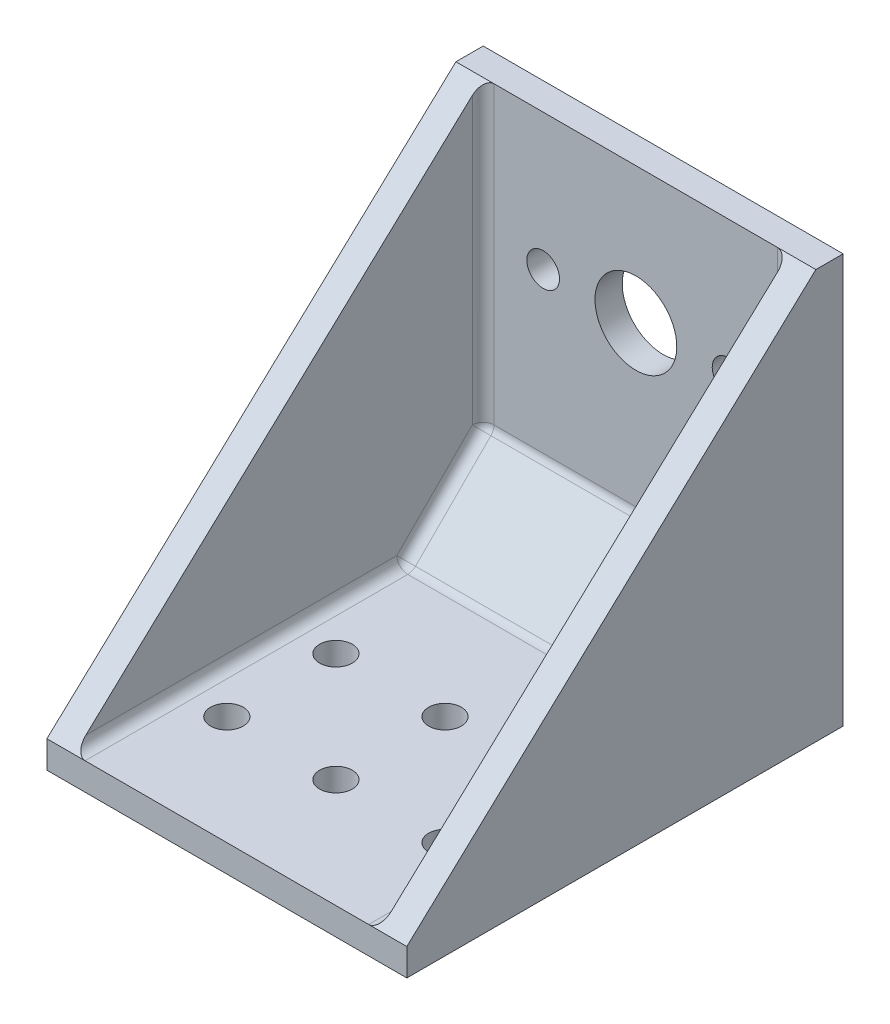
ISO-10303-21;
HEADER;
FILE_DESCRIPTION(('STEP AP214'),'2;1');
FILE_NAME('part.step','',(''),(''),'','','');
FILE_SCHEMA(('AUTOMOTIVE_DESIGN { 1 0 10303 214 1 1 1 1 }'));
ENDSEC;
DATA;
#1=APPLICATION_CONTEXT('core data for automotive mechanical design processes');
#2=APPLICATION_PROTOCOL_DEFINITION('international standard','automotive_design',2000,#1);
#3=PRODUCT_CONTEXT('',#1,'mechanical');
#4=PRODUCT('Part','Part','',(#3));
#5=PRODUCT_RELATED_PRODUCT_CATEGORY('part','',(#4));
#6=PRODUCT_DEFINITION_FORMATION('','',#4);
#7=PRODUCT_DEFINITION_CONTEXT('part definition',#1,'design');
#8=PRODUCT_DEFINITION('design','',#6,#7);
#9=PRODUCT_DEFINITION_SHAPE('','',#8);
#10=(LENGTH_UNIT() NAMED_UNIT(*) SI_UNIT(.MILLI.,.METRE.));
#11=(NAMED_UNIT(*) PLANE_ANGLE_UNIT() SI_UNIT($,.RADIAN.));
#12=(NAMED_UNIT(*) SI_UNIT($,.STERADIAN.) SOLID_ANGLE_UNIT());
#13=UNCERTAINTY_MEASURE_WITH_UNIT(LENGTH_MEASURE(1.E-05),#10,'distance_accuracy_value','');
#14=(GEOMETRIC_REPRESENTATION_CONTEXT(3) GLOBAL_UNCERTAINTY_ASSIGNED_CONTEXT((#13)) GLOBAL_UNIT_ASSIGNED_CONTEXT((#10,
#11,#12)) REPRESENTATION_CONTEXT('',''));
#15=CARTESIAN_POINT('',(0.,0.,0.));
#16=DIRECTION('',(0.,0.,1.));
#17=DIRECTION('',(1.,0.,0.));
#18=AXIS2_PLACEMENT_3D('',#15,#16,#17);
#19=CARTESIAN_POINT('',(28.,10.4142135623731,3.49999999999999));
#20=DIRECTION('',(1.,0.,0.));
#21=DIRECTION('',(0.,0.,-1.));
#22=AXIS2_PLACEMENT_3D('',#19,#20,#21);
#23=CYLINDRICAL_SURFACE('',#22,1.);
#24=DIRECTION('',(1.,0.,0.));
#25=VECTOR('',#24,1.);
#26=CARTESIAN_POINT('',(28.,10.4142135623731,2.49999999999999));
#27=LINE('',#26,#25);
#28=CARTESIAN_POINT('',(27.,10.4142135623731,2.49999999999999));
#29=VERTEX_POINT('',#28);
#30=CARTESIAN_POINT('',(1.,10.4142135623731,2.49999999999999));
#31=VERTEX_POINT('',#30);
#32=EDGE_CURVE('E259',#29,#31,#27,.F.);
#33=ORIENTED_EDGE('',*,*,#32,.T.);
#34=CARTESIAN_POINT('',(1.,10.4142135623731,3.49999999999999));
#35=DIRECTION('',(1.,0.,0.));
#36=DIRECTION('',(0.,0.,-1.));
#37=AXIS2_PLACEMENT_3D('',#34,#35,#36);
#38=CIRCLE('',#37,1.);
#39=CARTESIAN_POINT('',(0.999999999999989,9.70710678118656,2.79289321881344));
#40=VERTEX_POINT('',#39);
#41=EDGE_CURVE('E502',#31,#40,#38,.F.);
#42=ORIENTED_EDGE('',*,*,#41,.T.);
#43=DIRECTION('',(1.,0.,0.));
#44=VECTOR('',#43,1.);
#45=CARTESIAN_POINT('',(28.,9.70710678118656,2.79289321881344));
#46=LINE('',#45,#44);
#47=CARTESIAN_POINT('',(27.,9.70710678117505,2.79289321882494));
#48=VERTEX_POINT('',#47);
#49=EDGE_CURVE('E302',#40,#48,#46,.T.);
#50=ORIENTED_EDGE('',*,*,#49,.T.);
#51=CARTESIAN_POINT('',(27.,10.4142135623731,3.49999999999999));
#52=DIRECTION('',(1.,0.,0.));
#53=DIRECTION('',(0.,0.,-1.));
#54=AXIS2_PLACEMENT_3D('',#51,#52,#53);
#55=CIRCLE('',#54,1.);
#56=EDGE_CURVE('E271',#48,#29,#55,.T.);
#57=ORIENTED_EDGE('',*,*,#56,.T.);
#58=EDGE_LOOP('',(#33,#42,#50,#57));
#59=FACE_BOUND('',#58,.T.);
#60=ADVANCED_FACE('F18',(#59),#23,.F.);
#61=CARTESIAN_POINT('',(1.,10.7071067811866,3.20710678118654));
#62=DIRECTION('',(0.,0.707106781186548,-0.707106781186548));
#63=DIRECTION('',(0.,0.707106781186548,0.707106781186548));
#64=AXIS2_PLACEMENT_3D('',#61,#62,#63);
#65=CYLINDRICAL_SURFACE('',#64,1.);
#66=DIRECTION('',(0.,0.707106781186548,-0.707106781186548));
#67=VECTOR('',#66,1.);
#68=CARTESIAN_POINT('',(0.999999999999987,10.,2.49999999999999));
#69=LINE('',#68,#67);
#70=CARTESIAN_POINT('',(0.999999999999997,2.79289321881652,9.70710678118347));
#71=VERTEX_POINT('',#70);
#72=EDGE_CURVE('E309',#71,#40,#69,.T.);
#73=ORIENTED_EDGE('',*,*,#72,.T.);
#74=CARTESIAN_POINT('',(1.,10.4142135623731,3.49999999999999));
#75=DIRECTION('',(0.,0.707106781186548,-0.707106781186547));
#76=DIRECTION('',(1.,0.,0.));
#77=AXIS2_PLACEMENT_3D('',#74,#75,#76);
#78=CIRCLE('',#77,1.);
#79=CARTESIAN_POINT('',(0.,10.4142135623731,3.5));
#80=VERTEX_POINT('',#79);
#81=EDGE_CURVE('E312',#40,#80,#78,.T.);
#82=ORIENTED_EDGE('',*,*,#81,.T.);
#83=DIRECTION('',(0.,-0.707106781186548,0.707106781186548));
#84=VECTOR('',#83,1.);
#85=CARTESIAN_POINT('',(0.,10.4142135623731,3.49999999999999));
#86=LINE('',#85,#84);
#87=CARTESIAN_POINT('',(0.,3.50000000000001,10.4142135623731));
#88=VERTEX_POINT('',#87);
#89=EDGE_CURVE('E134',#80,#88,#86,.T.);
#90=ORIENTED_EDGE('',*,*,#89,.T.);
#91=CARTESIAN_POINT('',(1.,3.50000000000001,10.4142135623731));
#92=DIRECTION('',(0.,0.707106781198814,-0.707106781174281));
#93=DIRECTION('',(1.,0.,0.));
#94=AXIS2_PLACEMENT_3D('',#91,#92,#93);
#95=CIRCLE('',#94,1.);
#96=EDGE_CURVE('E298',#88,#71,#95,.F.);
#97=ORIENTED_EDGE('',*,*,#96,.T.);
#98=EDGE_LOOP('',(#73,#82,#90,#97));
#99=FACE_BOUND('',#98,.T.);
#100=ADVANCED_FACE('F329',(#99),#65,.F.);
#101=CARTESIAN_POINT('',(1.,10.4142135623731,3.49999999999999));
#102=DIRECTION('',(1.,0.,0.));
#103=DIRECTION('',(0.,0.,-1.));
#104=AXIS2_PLACEMENT_3D('',#101,#102,#103);
#105=SPHERICAL_SURFACE('',#104,1.);
#106=ORIENTED_EDGE('',*,*,#81,.F.);
#107=ORIENTED_EDGE('',*,*,#41,.F.);
#108=CARTESIAN_POINT('',(1.,10.4142135623731,3.49999999999999));
#109=DIRECTION('',(0.,1.,0.));
#110=DIRECTION('',(0.,0.,1.));
#111=AXIS2_PLACEMENT_3D('',#108,#109,#110);
#112=CIRCLE('',#111,1.);
#113=EDGE_CURVE('E131',#31,#80,#112,.T.);
#114=ORIENTED_EDGE('',*,*,#113,.T.);
#115=EDGE_LOOP('',(#106,#107,#114));
#116=FACE_BOUND('',#115,.T.);
#117=ADVANCED_FACE('F326',(#116),#105,.F.);
#118=CARTESIAN_POINT('',(28.,10.,2.49999999999999));
#119=DIRECTION('',(0.,-0.707106781186548,-0.707106781186548));
#120=DIRECTION('',(0.,0.707106781186548,-0.707106781186548));
#121=AXIS2_PLACEMENT_3D('',#118,#119,#120);
#122=PLANE('',#121);
#123=DIRECTION('',(0.,0.707106781186548,-0.707106781186548));
#124=VECTOR('',#123,1.);
#125=CARTESIAN_POINT('',(27.,6.25,6.25));
#126=LINE('',#125,#124);
#127=CARTESIAN_POINT('',(27.,2.79289321881346,9.70710678118654));
#128=VERTEX_POINT('',#127);
#129=EDGE_CURVE('E301',#128,#48,#126,.T.);
#130=ORIENTED_EDGE('',*,*,#129,.T.);
#131=ORIENTED_EDGE('',*,*,#49,.F.);
#132=ORIENTED_EDGE('',*,*,#72,.F.);
#133=DIRECTION('',(1.,0.,0.));
#134=VECTOR('',#133,1.);
#135=CARTESIAN_POINT('',(28.,2.79289321881346,9.70710678118654));
#136=LINE('',#135,#134);
#137=EDGE_CURVE('E236',#71,#128,#136,.T.);
#138=ORIENTED_EDGE('',*,*,#137,.T.);
#139=EDGE_LOOP('',(#130,#131,#132,#138));
#140=FACE_BOUND('',#139,.T.);
#141=ADVANCED_FACE('F328',(#140),#122,.F.);
#142=CARTESIAN_POINT('',(1.,3.5,10.4142135623731));
#143=DIRECTION('',(1.,0.,0.));
#144=DIRECTION('',(0.,0.,-1.));
#145=AXIS2_PLACEMENT_3D('',#142,#143,#144);
#146=SPHERICAL_SURFACE('',#145,1.);
#147=CARTESIAN_POINT('',(1.,3.5,10.4142135623731));
#148=DIRECTION('',(1.,0.,0.));
#149=DIRECTION('',(0.,0.,-1.));
#150=AXIS2_PLACEMENT_3D('',#147,#148,#149);
#151=CIRCLE('',#150,1.);
#152=CARTESIAN_POINT('',(1.,2.5,10.4142135623731));
#153=VERTEX_POINT('',#152);
#154=EDGE_CURVE('E224',#153,#71,#151,.T.);
#155=ORIENTED_EDGE('',*,*,#154,.T.);
#156=ORIENTED_EDGE('',*,*,#96,.F.);
#157=CARTESIAN_POINT('',(1.,3.5,10.4142135623731));
#158=DIRECTION('',(0.,0.,-1.));
#159=DIRECTION('',(0.,1.,0.));
#160=AXIS2_PLACEMENT_3D('',#157,#158,#159);
#161=CIRCLE('',#160,1.);
#162=EDGE_CURVE('E246',#88,#153,#161,.F.);
#163=ORIENTED_EDGE('',*,*,#162,.T.);
#164=EDGE_LOOP('',(#155,#156,#163));
#165=FACE_BOUND('',#164,.T.);
#166=ADVANCED_FACE('F288',(#165),#146,.F.);
#167=CARTESIAN_POINT('',(27.,3.5,10.4142135623731));
#168=DIRECTION('',(1.,0.,0.));
#169=DIRECTION('',(0.,0.,-1.));
#170=AXIS2_PLACEMENT_3D('',#167,#168,#169);
#171=SPHERICAL_SURFACE('',#170,1.);
#172=CARTESIAN_POINT('',(27.,3.5,10.4142135623731));
#173=DIRECTION('',(0.,0.,-1.));
#174=DIRECTION('',(0.,1.,0.));
#175=AXIS2_PLACEMENT_3D('',#172,#173,#174);
#176=CIRCLE('',#175,1.);
#177=CARTESIAN_POINT('',(27.,2.5,10.4142135623731));
#178=VERTEX_POINT('',#177);
#179=CARTESIAN_POINT('',(28.,3.5,10.4142135623731));
#180=VERTEX_POINT('',#179);
#181=EDGE_CURVE('E219',#178,#180,#176,.F.);
#182=ORIENTED_EDGE('',*,*,#181,.T.);
#183=CARTESIAN_POINT('',(27.,3.5,10.4142135623731));
#184=DIRECTION('',(0.,0.707106781186548,-0.707106781186548));
#185=DIRECTION('',(0.,0.707106781186548,0.707106781186548));
#186=AXIS2_PLACEMENT_3D('',#183,#184,#185);
#187=CIRCLE('',#186,1.);
#188=EDGE_CURVE('E508',#180,#128,#187,.T.);
#189=ORIENTED_EDGE('',*,*,#188,.T.);
#190=CARTESIAN_POINT('',(27.,3.5,10.4142135623731));
#191=DIRECTION('',(1.,0.,0.));
#192=DIRECTION('',(0.,0.,-1.));
#193=AXIS2_PLACEMENT_3D('',#190,#191,#192);
#194=CIRCLE('',#193,1.);
#195=EDGE_CURVE('E233',#128,#178,#194,.F.);
#196=ORIENTED_EDGE('',*,*,#195,.T.);
#197=EDGE_LOOP('',(#182,#189,#196));
#198=FACE_BOUND('',#197,.T.);
#199=ADVANCED_FACE('F283',(#198),#171,.F.);
#200=CARTESIAN_POINT('',(27.,6.95710678118655,6.95710678118655));
#201=DIRECTION('',(0.,0.707106781186548,-0.707106781186548));
#202=DIRECTION('',(0.,0.707106781186548,0.707106781186548));
#203=AXIS2_PLACEMENT_3D('',#200,#201,#202);
#204=CYLINDRICAL_SURFACE('',#203,1.);
#205=DIRECTION('',(0.,0.707106781186548,-0.707106781186548));
#206=VECTOR('',#205,1.);
#207=CARTESIAN_POINT('',(28.,3.5,10.4142135623731));
#208=LINE('',#207,#206);
#209=CARTESIAN_POINT('',(28.,10.4142135623731,3.49999999999999));
#210=VERTEX_POINT('',#209);
#211=EDGE_CURVE('E213',#180,#210,#208,.T.);
#212=ORIENTED_EDGE('',*,*,#211,.T.);
#213=CARTESIAN_POINT('',(27.,10.4142135623731,3.49999999999999));
#214=DIRECTION('',(0.,0.707106781171215,-0.707106781201881));
#215=DIRECTION('',(1.,0.,0.));
#216=AXIS2_PLACEMENT_3D('',#213,#214,#215);
#217=CIRCLE('',#216,1.);
#218=EDGE_CURVE('E262',#210,#48,#217,.T.);
#219=ORIENTED_EDGE('',*,*,#218,.T.);
#220=ORIENTED_EDGE('',*,*,#129,.F.);
#221=ORIENTED_EDGE('',*,*,#188,.F.);
#222=EDGE_LOOP('',(#212,#219,#220,#221));
#223=FACE_BOUND('',#222,.T.);
#224=ADVANCED_FACE('F278',(#223),#204,.F.);
#225=CARTESIAN_POINT('',(27.,10.4142135623731,3.49999999999999));
#226=DIRECTION('',(1.,0.,0.));
#227=DIRECTION('',(0.,0.,-1.));
#228=AXIS2_PLACEMENT_3D('',#225,#226,#227);
#229=SPHERICAL_SURFACE('',#228,1.);
#230=CARTESIAN_POINT('',(27.,10.4142135623731,3.49999999999999));
#231=DIRECTION('',(0.,1.,0.));
#232=DIRECTION('',(0.,0.,1.));
#233=AXIS2_PLACEMENT_3D('',#230,#231,#232);
#234=CIRCLE('',#233,1.);
#235=EDGE_CURVE('E207',#210,#29,#234,.T.);
#236=ORIENTED_EDGE('',*,*,#235,.T.);
#237=ORIENTED_EDGE('',*,*,#56,.F.);
#238=ORIENTED_EDGE('',*,*,#218,.F.);
#239=EDGE_LOOP('',(#236,#237,#238));
#240=FACE_BOUND('',#239,.T.);
#241=ADVANCED_FACE('F274',(#240),#229,.F.);
#242=CARTESIAN_POINT('',(28.,37.5,2.5));
#243=DIRECTION('',(0.,0.,-1.));
#244=DIRECTION('',(0.,1.,0.));
#245=AXIS2_PLACEMENT_3D('',#242,#243,#244);
#246=PLANE('',#245);
#247=DIRECTION('',(0.,1.,0.));
#248=VECTOR('',#247,1.);
#249=CARTESIAN_POINT('',(27.,0.,2.49999999999999));
#250=LINE('',#249,#248);
#251=CARTESIAN_POINT('',(27.,37.5,2.5));
#252=VERTEX_POINT('',#251);
#253=EDGE_CURVE('E147',#29,#252,#250,.T.);
#254=ORIENTED_EDGE('',*,*,#253,.T.);
#255=DIRECTION('',(1.,0.,0.));
#256=VECTOR('',#255,1.);
#257=CARTESIAN_POINT('',(28.,37.5,2.5));
#258=LINE('',#257,#256);
#259=CARTESIAN_POINT('',(1.,37.5,2.5));
#260=VERTEX_POINT('',#259);
#261=EDGE_CURVE('E143',#252,#260,#258,.F.);
#262=ORIENTED_EDGE('',*,*,#261,.T.);
#263=DIRECTION('',(0.,1.,0.));
#264=VECTOR('',#263,1.);
#265=CARTESIAN_POINT('',(1.,37.5,2.5));
#266=LINE('',#265,#264);
#267=EDGE_CURVE('E126',#260,#31,#266,.F.);
#268=ORIENTED_EDGE('',*,*,#267,.T.);
#269=ORIENTED_EDGE('',*,*,#32,.F.);
#270=EDGE_LOOP('',(#254,#262,#268,#269));
#271=FACE_BOUND('',#270,.T.);
#272=CARTESIAN_POINT('',(5.5,25.,2.5));
#273=DIRECTION('',(0.,0.,-1.));
#274=DIRECTION('',(0.,1.,0.));
#275=AXIS2_PLACEMENT_3D('',#272,#273,#274);
#276=CIRCLE('',#275,1.5);
#277=CARTESIAN_POINT('',(5.5,26.5,2.5));
#278=VERTEX_POINT('',#277);
#279=EDGE_CURVE('E150',#278,#278,#276,.T.);
#280=ORIENTED_EDGE('',*,*,#279,.T.);
#281=EDGE_LOOP('',(#280));
#282=FACE_BOUND('',#281,.T.);
#283=CARTESIAN_POINT('',(14.,25.,2.5));
#284=DIRECTION('',(0.,0.,-1.));
#285=DIRECTION('',(0.,1.,0.));
#286=AXIS2_PLACEMENT_3D('',#283,#284,#285);
#287=CIRCLE('',#286,3.75);
#288=CARTESIAN_POINT('',(14.,28.75,2.49999999999999));
#289=VERTEX_POINT('',#288);
#290=EDGE_CURVE('E571',#289,#289,#287,.T.);
#291=ORIENTED_EDGE('',*,*,#290,.T.);
#292=EDGE_LOOP('',(#291));
#293=FACE_BOUND('',#292,.T.);
#294=CARTESIAN_POINT('',(22.5,25.,2.5));
#295=DIRECTION('',(0.,0.,-1.));
#296=DIRECTION('',(0.,1.,0.));
#297=AXIS2_PLACEMENT_3D('',#294,#295,#296);
#298=CIRCLE('',#297,1.5);
#299=CARTESIAN_POINT('',(22.5,26.5,2.5));
#300=VERTEX_POINT('',#299);
#301=EDGE_CURVE('E21',#300,#300,#298,.T.);
#302=ORIENTED_EDGE('',*,*,#301,.T.);
#303=EDGE_LOOP('',(#302));
#304=FACE_BOUND('',#303,.T.);
#305=ADVANCED_FACE('F144',(#271,#282,#293,#304),#246,.F.);
#306=CARTESIAN_POINT('',(0.,0.,0.));
#307=DIRECTION('',(-1.,0.,0.));
#308=DIRECTION('',(0.,0.,1.));
#309=AXIS2_PLACEMENT_3D('',#306,#307,#308);
#310=PLANE('',#309);
#311=DIRECTION('',(0.,0.,-1.));
#312=VECTOR('',#311,1.);
#313=CARTESIAN_POINT('',(0.,3.50000000000001,9.99999999999999));
#314=LINE('',#313,#312);
#315=CARTESIAN_POINT('',(0.,3.5,38.9285714285714));
#316=VERTEX_POINT('',#315);
#317=EDGE_CURVE('E243',#316,#88,#314,.T.);
#318=ORIENTED_EDGE('',*,*,#317,.T.);
#319=ORIENTED_EDGE('',*,*,#89,.F.);
#320=DIRECTION('',(0.,1.,0.));
#321=VECTOR('',#320,1.);
#322=CARTESIAN_POINT('',(0.,37.5,3.5));
#323=LINE('',#322,#321);
#324=CARTESIAN_POINT('',(0.,36.5666666666667,3.5));
#325=VERTEX_POINT('',#324);
#326=EDGE_CURVE('E247',#80,#325,#323,.T.);
#327=ORIENTED_EDGE('',*,*,#326,.T.);
#328=DIRECTION('',(0.,-0.682318250360011,0.731055268242869));
#329=VECTOR('',#328,1.);
#330=CARTESIAN_POINT('',(0.,21.2885985748219,19.8693586698337));
#331=LINE('',#330,#329);
#332=EDGE_CURVE('E119',#316,#325,#331,.F.);
#333=ORIENTED_EDGE('',*,*,#332,.F.);
#334=EDGE_LOOP('',(#318,#319,#327,#333));
#335=FACE_BOUND('',#334,.T.);
#336=ADVANCED_FACE('F431',(#335),#310,.F.);
#337=CARTESIAN_POINT('',(1.,37.5,3.5));
#338=DIRECTION('',(0.,1.,0.));
#339=DIRECTION('',(0.,0.,1.));
#340=AXIS2_PLACEMENT_3D('',#337,#338,#339);
#341=CYLINDRICAL_SURFACE('',#340,1.);
#342=ORIENTED_EDGE('',*,*,#326,.F.);
#343=ORIENTED_EDGE('',*,*,#113,.F.);
#344=ORIENTED_EDGE('',*,*,#267,.F.);
#345=CARTESIAN_POINT('',(1.,36.5666666666667,3.5));
#346=DIRECTION('',(0.,0.731055268242869,0.682318250360011));
#347=DIRECTION('',(0.,0.682318250360011,-0.731055268242869));
#348=AXIS2_PLACEMENT_3D('',#345,#346,#347);
#349=ELLIPSE('',#348,1.36788563524555,1.);
#350=EDGE_CURVE('E129',#325,#260,#349,.F.);
#351=ORIENTED_EDGE('',*,*,#350,.F.);
#352=EDGE_LOOP('',(#342,#343,#344,#351));
#353=FACE_BOUND('',#352,.T.);
#354=ADVANCED_FACE('F128',(#353),#341,.F.);
#355=CARTESIAN_POINT('',(1.,3.5,9.99999999999999));
#356=DIRECTION('',(0.,0.,-1.));
#357=DIRECTION('',(0.,1.,0.));
#358=AXIS2_PLACEMENT_3D('',#355,#356,#357);
#359=CYLINDRICAL_SURFACE('',#358,1.);
#360=DIRECTION('',(0.,0.,-1.));
#361=VECTOR('',#360,1.);
#362=CARTESIAN_POINT('',(1.,2.5,9.99999999999999));
#363=LINE('',#362,#361);
#364=CARTESIAN_POINT('',(1.,2.5,40.));
#365=VERTEX_POINT('',#364);
#366=EDGE_CURVE('E159',#365,#153,#363,.T.);
#367=ORIENTED_EDGE('',*,*,#366,.T.);
#368=ORIENTED_EDGE('',*,*,#162,.F.);
#369=ORIENTED_EDGE('',*,*,#317,.F.);
#370=CARTESIAN_POINT('',(1.,3.5,38.9285714285714));
#371=DIRECTION('',(0.,0.731055268242869,0.682318250360011));
#372=DIRECTION('',(0.,0.682318250360011,-0.731055268242869));
#373=AXIS2_PLACEMENT_3D('',#370,#371,#372);
#374=ELLIPSE('',#373,1.4655917520488,1.);
#375=EDGE_CURVE('E157',#365,#316,#374,.F.);
#376=ORIENTED_EDGE('',*,*,#375,.F.);
#377=EDGE_LOOP('',(#367,#368,#369,#376));
#378=FACE_BOUND('',#377,.T.);
#379=ADVANCED_FACE('F425',(#378),#359,.F.);
#380=CARTESIAN_POINT('',(28.,3.5,10.4142135623731));
#381=DIRECTION('',(1.,0.,0.));
#382=DIRECTION('',(0.,0.,-1.));
#383=AXIS2_PLACEMENT_3D('',#380,#381,#382);
#384=CYLINDRICAL_SURFACE('',#383,1.);
#385=DIRECTION('',(1.,0.,0.));
#386=VECTOR('',#385,1.);
#387=CARTESIAN_POINT('',(28.,2.5,10.4142135623731));
#388=LINE('',#387,#386);
#389=EDGE_CURVE('E227',#153,#178,#388,.T.);
#390=ORIENTED_EDGE('',*,*,#389,.T.);
#391=ORIENTED_EDGE('',*,*,#195,.F.);
#392=ORIENTED_EDGE('',*,*,#137,.F.);
#393=ORIENTED_EDGE('',*,*,#154,.F.);
#394=EDGE_LOOP('',(#390,#391,#392,#393));
#395=FACE_BOUND('',#394,.T.);
#396=ADVANCED_FACE('F421',(#395),#384,.F.);
#397=CARTESIAN_POINT('',(27.,3.50000000000001,0.));
#398=DIRECTION('',(0.,0.,-1.));
#399=DIRECTION('',(0.,1.,0.));
#400=AXIS2_PLACEMENT_3D('',#397,#398,#399);
#401=CYLINDRICAL_SURFACE('',#400,1.);
#402=DIRECTION('',(0.,0.,-1.));
#403=VECTOR('',#402,1.);
#404=CARTESIAN_POINT('',(28.,3.5,0.));
#405=LINE('',#404,#403);
#406=CARTESIAN_POINT('',(28.,3.5,38.9285714285714));
#407=VERTEX_POINT('',#406);
#408=EDGE_CURVE('E216',#407,#180,#405,.T.);
#409=ORIENTED_EDGE('',*,*,#408,.T.);
#410=ORIENTED_EDGE('',*,*,#181,.F.);
#411=DIRECTION('',(0.,0.,-1.));
#412=VECTOR('',#411,1.);
#413=CARTESIAN_POINT('',(27.,2.5,9.99999999999999));
#414=LINE('',#413,#412);
#415=CARTESIAN_POINT('',(27.,2.5,40.));
#416=VERTEX_POINT('',#415);
#417=EDGE_CURVE('E230',#178,#416,#414,.F.);
#418=ORIENTED_EDGE('',*,*,#417,.T.);
#419=CARTESIAN_POINT('',(27.,3.5,38.9285714285714));
#420=DIRECTION('',(0.,-0.731055268242869,-0.682318250360011));
#421=DIRECTION('',(0.,0.682318250360011,-0.731055268242869));
#422=AXIS2_PLACEMENT_3D('',#419,#420,#421);
#423=ELLIPSE('',#422,1.4655917520488,1.);
#424=EDGE_CURVE('E454',#416,#407,#423,.F.);
#425=ORIENTED_EDGE('',*,*,#424,.T.);
#426=EDGE_LOOP('',(#409,#410,#418,#425));
#427=FACE_BOUND('',#426,.T.);
#428=ADVANCED_FACE('F417',(#427),#401,.F.);
#429=CARTESIAN_POINT('',(28.,0.,0.));
#430=DIRECTION('',(1.,0.,0.));
#431=DIRECTION('',(0.,0.,-1.));
#432=AXIS2_PLACEMENT_3D('',#429,#430,#431);
#433=PLANE('',#432);
#434=ORIENTED_EDGE('',*,*,#408,.F.);
#435=DIRECTION('',(0.,0.682318250360011,-0.731055268242869));
#436=VECTOR('',#435,1.);
#437=CARTESIAN_POINT('',(28.,21.2885985748219,19.8693586698337));
#438=LINE('',#437,#436);
#439=CARTESIAN_POINT('',(28.,36.5666666666667,3.5));
#440=VERTEX_POINT('',#439);
#441=EDGE_CURVE('E464',#407,#440,#438,.T.);
#442=ORIENTED_EDGE('',*,*,#441,.T.);
#443=DIRECTION('',(0.,1.,0.));
#444=VECTOR('',#443,1.);
#445=CARTESIAN_POINT('',(28.,0.,3.49999999999999));
#446=LINE('',#445,#444);
#447=EDGE_CURVE('E210',#440,#210,#446,.F.);
#448=ORIENTED_EDGE('',*,*,#447,.T.);
#449=ORIENTED_EDGE('',*,*,#211,.F.);
#450=EDGE_LOOP('',(#434,#442,#448,#449));
#451=FACE_BOUND('',#450,.T.);
#452=ADVANCED_FACE('F413',(#451),#433,.F.);
#453=CARTESIAN_POINT('',(27.,0.,3.49999999999999));
#454=DIRECTION('',(0.,1.,0.));
#455=DIRECTION('',(0.,0.,1.));
#456=AXIS2_PLACEMENT_3D('',#453,#454,#455);
#457=CYLINDRICAL_SURFACE('',#456,1.);
#458=ORIENTED_EDGE('',*,*,#253,.F.);
#459=ORIENTED_EDGE('',*,*,#235,.F.);
#460=ORIENTED_EDGE('',*,*,#447,.F.);
#461=CARTESIAN_POINT('',(27.,36.5666666666667,3.5));
#462=DIRECTION('',(0.,-0.731055268242869,-0.682318250360011));
#463=DIRECTION('',(0.,0.682318250360011,-0.731055268242869));
#464=AXIS2_PLACEMENT_3D('',#461,#462,#463);
#465=ELLIPSE('',#464,1.36788563524555,1.);
#466=EDGE_CURVE('E467',#440,#252,#465,.F.);
#467=ORIENTED_EDGE('',*,*,#466,.T.);
#468=EDGE_LOOP('',(#458,#459,#460,#467));
#469=FACE_BOUND('',#468,.T.);
#470=ADVANCED_FACE('F409',(#469),#457,.F.);
#471=CARTESIAN_POINT('',(22.5,25.,40.));
#472=DIRECTION('',(0.,0.,-1.));
#473=DIRECTION('',(0.,1.,0.));
#474=AXIS2_PLACEMENT_3D('',#471,#472,#473);
#475=CYLINDRICAL_SURFACE('',#474,1.5);
#476=ORIENTED_EDGE('',*,*,#301,.F.);
#477=EDGE_LOOP('',(#476));
#478=FACE_BOUND('',#477,.T.);
#479=CARTESIAN_POINT('',(22.5,25.,0.));
#480=DIRECTION('',(0.,0.,-1.));
#481=DIRECTION('',(0.,1.,0.));
#482=AXIS2_PLACEMENT_3D('',#479,#480,#481);
#483=CIRCLE('',#482,1.5);
#484=CARTESIAN_POINT('',(22.5,26.5,0.));
#485=VERTEX_POINT('',#484);
#486=EDGE_CURVE('E203',#485,#485,#483,.T.);
#487=ORIENTED_EDGE('',*,*,#486,.T.);
#488=EDGE_LOOP('',(#487));
#489=FACE_BOUND('',#488,.T.);
#490=ADVANCED_FACE('F405',(#478,#489),#475,.F.);
#491=CARTESIAN_POINT('',(14.,25.,40.));
#492=DIRECTION('',(0.,0.,-1.));
#493=DIRECTION('',(0.,1.,0.));
#494=AXIS2_PLACEMENT_3D('',#491,#492,#493);
#495=CYLINDRICAL_SURFACE('',#494,3.75);
#496=ORIENTED_EDGE('',*,*,#290,.F.);
#497=EDGE_LOOP('',(#496));
#498=FACE_BOUND('',#497,.T.);
#499=CARTESIAN_POINT('',(14.,25.,0.));
#500=DIRECTION('',(0.,0.,-1.));
#501=DIRECTION('',(0.,1.,0.));
#502=AXIS2_PLACEMENT_3D('',#499,#500,#501);
#503=CIRCLE('',#502,3.75);
#504=CARTESIAN_POINT('',(14.,28.75,0.));
#505=VERTEX_POINT('',#504);
#506=EDGE_CURVE('E547',#505,#505,#503,.T.);
#507=ORIENTED_EDGE('',*,*,#506,.T.);
#508=EDGE_LOOP('',(#507));
#509=FACE_BOUND('',#508,.T.);
#510=ADVANCED_FACE('F401',(#498,#509),#495,.F.);
#511=CARTESIAN_POINT('',(5.5,25.,40.));
#512=DIRECTION('',(0.,0.,-1.));
#513=DIRECTION('',(0.,1.,0.));
#514=AXIS2_PLACEMENT_3D('',#511,#512,#513);
#515=CYLINDRICAL_SURFACE('',#514,1.5);
#516=ORIENTED_EDGE('',*,*,#279,.F.);
#517=EDGE_LOOP('',(#516));
#518=FACE_BOUND('',#517,.T.);
#519=CARTESIAN_POINT('',(5.5,25.,0.));
#520=DIRECTION('',(0.,0.,-1.));
#521=DIRECTION('',(0.,1.,0.));
#522=AXIS2_PLACEMENT_3D('',#519,#520,#521);
#523=CIRCLE('',#522,1.5);
#524=CARTESIAN_POINT('',(5.5,26.5,0.));
#525=VERTEX_POINT('',#524);
#526=EDGE_CURVE('E476',#525,#525,#523,.T.);
#527=ORIENTED_EDGE('',*,*,#526,.T.);
#528=EDGE_LOOP('',(#527));
#529=FACE_BOUND('',#528,.T.);
#530=ADVANCED_FACE('F398',(#518,#529),#515,.F.);
#531=CARTESIAN_POINT('',(28.,37.5,0.));
#532=DIRECTION('',(0.,-1.,0.));
#533=DIRECTION('',(0.,0.,-1.));
#534=AXIS2_PLACEMENT_3D('',#531,#532,#533);
#535=PLANE('',#534);
#536=DIRECTION('',(0.,0.,1.));
#537=VECTOR('',#536,1.);
#538=CARTESIAN_POINT('',(-2.5,37.5,0.));
#539=LINE('',#538,#537);
#540=CARTESIAN_POINT('',(-2.5,37.5,2.5));
#541=VERTEX_POINT('',#540);
#542=CARTESIAN_POINT('',(-2.5,37.5,0.));
#543=VERTEX_POINT('',#542);
#544=EDGE_CURVE('E156',#541,#543,#539,.F.);
#545=ORIENTED_EDGE('',*,*,#544,.F.);
#546=DIRECTION('',(1.,0.,0.));
#547=VECTOR('',#546,1.);
#548=CARTESIAN_POINT('',(-2.5,37.5,2.5));
#549=LINE('',#548,#547);
#550=EDGE_CURVE('E139',#260,#541,#549,.F.);
#551=ORIENTED_EDGE('',*,*,#550,.F.);
#552=ORIENTED_EDGE('',*,*,#261,.F.);
#553=DIRECTION('',(1.,0.,0.));
#554=VECTOR('',#553,1.);
#555=CARTESIAN_POINT('',(30.5,37.5,2.5));
#556=LINE('',#555,#554);
#557=CARTESIAN_POINT('',(30.5,37.5,2.5));
#558=VERTEX_POINT('',#557);
#559=EDGE_CURVE('E470',#252,#558,#556,.T.);
#560=ORIENTED_EDGE('',*,*,#559,.T.);
#561=DIRECTION('',(0.,0.,-1.));
#562=VECTOR('',#561,1.);
#563=CARTESIAN_POINT('',(30.5,37.5,0.));
#564=LINE('',#563,#562);
#565=CARTESIAN_POINT('',(30.5,37.5,0.));
#566=VERTEX_POINT('',#565);
#567=EDGE_CURVE('E187',#566,#558,#564,.F.);
#568=ORIENTED_EDGE('',*,*,#567,.F.);
#569=DIRECTION('',(1.,0.,0.));
#570=VECTOR('',#569,1.);
#571=CARTESIAN_POINT('',(28.,37.5,0.));
#572=LINE('',#571,#570);
#573=EDGE_CURVE('E175',#566,#543,#572,.F.);
#574=ORIENTED_EDGE('',*,*,#573,.T.);
#575=EDGE_LOOP('',(#545,#551,#552,#560,#568,#574));
#576=FACE_BOUND('',#575,.T.);
#577=ADVANCED_FACE('F153',(#576),#535,.F.);
#578=CARTESIAN_POINT('',(-2.5,21.2885985748219,19.8693586698337));
#579=DIRECTION('',(0.,0.731055268242869,0.682318250360011));
#580=DIRECTION('',(0.,-0.682318250360011,0.731055268242869));
#581=AXIS2_PLACEMENT_3D('',#578,#579,#580);
#582=PLANE('',#581);
#583=DIRECTION('',(-1.,0.,0.));
#584=VECTOR('',#583,1.);
#585=CARTESIAN_POINT('',(28.,2.5,40.));
#586=LINE('',#585,#584);
#587=CARTESIAN_POINT('',(-2.5,2.5,40.));
#588=VERTEX_POINT('',#587);
#589=EDGE_CURVE('E169',#588,#365,#586,.F.);
#590=ORIENTED_EDGE('',*,*,#589,.T.);
#591=ORIENTED_EDGE('',*,*,#375,.T.);
#592=ORIENTED_EDGE('',*,*,#332,.T.);
#593=ORIENTED_EDGE('',*,*,#350,.T.);
#594=ORIENTED_EDGE('',*,*,#550,.T.);
#595=DIRECTION('',(0.,0.682318250360011,-0.731055268242869));
#596=VECTOR('',#595,1.);
#597=CARTESIAN_POINT('',(-2.5,2.5,40.));
#598=LINE('',#597,#596);
#599=EDGE_CURVE('E173',#588,#541,#598,.T.);
#600=ORIENTED_EDGE('',*,*,#599,.F.);
#601=EDGE_LOOP('',(#590,#591,#592,#593,#594,#600));
#602=FACE_BOUND('',#601,.T.);
#603=ADVANCED_FACE('F137',(#602),#582,.T.);
#604=CARTESIAN_POINT('',(28.,2.5,9.99999999999999));
#605=DIRECTION('',(0.,-1.,0.));
#606=DIRECTION('',(0.,0.,-1.));
#607=AXIS2_PLACEMENT_3D('',#604,#605,#606);
#608=PLANE('',#607);
#609=ORIENTED_EDGE('',*,*,#417,.F.);
#610=ORIENTED_EDGE('',*,*,#389,.F.);
#611=ORIENTED_EDGE('',*,*,#366,.F.);
#612=DIRECTION('',(-1.,0.,0.));
#613=VECTOR('',#612,1.);
#614=CARTESIAN_POINT('',(28.,2.5,40.));
#615=LINE('',#614,#613);
#616=EDGE_CURVE('E442',#365,#416,#615,.F.);
#617=ORIENTED_EDGE('',*,*,#616,.T.);
#618=EDGE_LOOP('',(#609,#610,#611,#617));
#619=FACE_BOUND('',#618,.T.);
#620=CARTESIAN_POINT('',(24.,2.5,20.));
#621=DIRECTION('',(0.,-1.,0.));
#622=DIRECTION('',(0.,0.,-1.));
#623=AXIS2_PLACEMENT_3D('',#620,#621,#622);
#624=CIRCLE('',#623,1.5);
#625=CARTESIAN_POINT('',(24.,2.5,18.5));
#626=VERTEX_POINT('',#625);
#627=EDGE_CURVE('E188',#626,#626,#624,.T.);
#628=ORIENTED_EDGE('',*,*,#627,.T.);
#629=EDGE_LOOP('',(#628));
#630=FACE_BOUND('',#629,.T.);
#631=CARTESIAN_POINT('',(24.,2.5,30.));
#632=DIRECTION('',(0.,-1.,0.));
#633=DIRECTION('',(0.,0.,-1.));
#634=AXIS2_PLACEMENT_3D('',#631,#632,#633);
#635=CIRCLE('',#634,1.5);
#636=CARTESIAN_POINT('',(24.,2.5,28.5));
#637=VERTEX_POINT('',#636);
#638=EDGE_CURVE('E554',#637,#637,#635,.T.);
#639=ORIENTED_EDGE('',*,*,#638,.T.);
#640=EDGE_LOOP('',(#639));
#641=FACE_BOUND('',#640,.T.);
#642=CARTESIAN_POINT('',(14.,2.5,19.9999999999999));
#643=DIRECTION('',(0.,-1.,0.));
#644=DIRECTION('',(0.,0.,-1.));
#645=AXIS2_PLACEMENT_3D('',#642,#643,#644);
#646=CIRCLE('',#645,1.5);
#647=CARTESIAN_POINT('',(14.,2.5,18.4999999999999));
#648=VERTEX_POINT('',#647);
#649=EDGE_CURVE('E557',#648,#648,#646,.T.);
#650=ORIENTED_EDGE('',*,*,#649,.T.);
#651=EDGE_LOOP('',(#650));
#652=FACE_BOUND('',#651,.T.);
#653=CARTESIAN_POINT('',(14.,2.5,29.9999999999999));
#654=DIRECTION('',(0.,-1.,0.));
#655=DIRECTION('',(0.,0.,-1.));
#656=AXIS2_PLACEMENT_3D('',#653,#654,#655);
#657=CIRCLE('',#656,1.5);
#658=CARTESIAN_POINT('',(14.,2.5,28.4999999999999));
#659=VERTEX_POINT('',#658);
#660=EDGE_CURVE('E560',#659,#659,#657,.T.);
#661=ORIENTED_EDGE('',*,*,#660,.T.);
#662=EDGE_LOOP('',(#661));
#663=FACE_BOUND('',#662,.T.);
#664=CARTESIAN_POINT('',(4.,2.5,19.9999999999999));
#665=DIRECTION('',(0.,-1.,0.));
#666=DIRECTION('',(0.,0.,-1.));
#667=AXIS2_PLACEMENT_3D('',#664,#665,#666);
#668=CIRCLE('',#667,1.5);
#669=CARTESIAN_POINT('',(4.,2.5,18.4999999999999));
#670=VERTEX_POINT('',#669);
#671=EDGE_CURVE('E563',#670,#670,#668,.T.);
#672=ORIENTED_EDGE('',*,*,#671,.T.);
#673=EDGE_LOOP('',(#672));
#674=FACE_BOUND('',#673,.T.);
#675=CARTESIAN_POINT('',(3.99999999999997,2.5,29.9999999999999));
#676=DIRECTION('',(0.,-1.,0.));
#677=DIRECTION('',(0.,0.,-1.));
#678=AXIS2_PLACEMENT_3D('',#675,#676,#677);
#679=CIRCLE('',#678,1.5);
#680=CARTESIAN_POINT('',(3.99999999999997,2.5,28.4999999999999));
#681=VERTEX_POINT('',#680);
#682=EDGE_CURVE('E472',#681,#681,#679,.T.);
#683=ORIENTED_EDGE('',*,*,#682,.T.);
#684=EDGE_LOOP('',(#683));
#685=FACE_BOUND('',#684,.T.);
#686=ADVANCED_FACE('F389',(#619,#630,#641,#652,#663,#674,#685),#608,.F.);
#687=CARTESIAN_POINT('',(30.5,21.2885985748219,19.8693586698337));
#688=DIRECTION('',(0.,-0.731055268242869,-0.682318250360011));
#689=DIRECTION('',(0.,0.682318250360011,-0.731055268242869));
#690=AXIS2_PLACEMENT_3D('',#687,#688,#689);
#691=PLANE('',#690);
#692=ORIENTED_EDGE('',*,*,#466,.F.);
#693=ORIENTED_EDGE('',*,*,#441,.F.);
#694=ORIENTED_EDGE('',*,*,#424,.F.);
#695=DIRECTION('',(-1.,0.,0.));
#696=VECTOR('',#695,1.);
#697=CARTESIAN_POINT('',(28.,2.5,40.));
#698=LINE('',#697,#696);
#699=CARTESIAN_POINT('',(30.5,2.5,40.));
#700=VERTEX_POINT('',#699);
#701=EDGE_CURVE('E444',#416,#700,#698,.F.);
#702=ORIENTED_EDGE('',*,*,#701,.T.);
#703=DIRECTION('',(0.,-0.682318250360011,0.731055268242869));
#704=VECTOR('',#703,1.);
#705=CARTESIAN_POINT('',(30.5,37.5,2.5));
#706=LINE('',#705,#704);
#707=EDGE_CURVE('E185',#558,#700,#706,.T.);
#708=ORIENTED_EDGE('',*,*,#707,.F.);
#709=ORIENTED_EDGE('',*,*,#559,.F.);
#710=EDGE_LOOP('',(#692,#693,#694,#702,#708,#709));
#711=FACE_BOUND('',#710,.T.);
#712=ADVANCED_FACE('F385',(#711),#691,.F.);
#713=CARTESIAN_POINT('',(3.99999999999997,37.5,29.9999999999999));
#714=DIRECTION('',(0.,-1.,0.));
#715=DIRECTION('',(0.,0.,-1.));
#716=AXIS2_PLACEMENT_3D('',#713,#714,#715);
#717=CYLINDRICAL_SURFACE('',#716,1.5);
#718=ORIENTED_EDGE('',*,*,#682,.F.);
#719=EDGE_LOOP('',(#718));
#720=FACE_BOUND('',#719,.T.);
#721=CARTESIAN_POINT('',(3.99999999999997,0.,29.9999999999999));
#722=DIRECTION('',(0.,-1.,0.));
#723=DIRECTION('',(0.,0.,-1.));
#724=AXIS2_PLACEMENT_3D('',#721,#722,#723);
#725=CIRCLE('',#724,1.5);
#726=CARTESIAN_POINT('',(3.99999999999997,0.,28.4999999999999));
#727=VERTEX_POINT('',#726);
#728=EDGE_CURVE('E462',#727,#727,#725,.T.);
#729=ORIENTED_EDGE('',*,*,#728,.T.);
#730=EDGE_LOOP('',(#729));
#731=FACE_BOUND('',#730,.T.);
#732=ADVANCED_FACE('F381',(#720,#731),#717,.F.);
#733=CARTESIAN_POINT('',(4.,37.5,19.9999999999999));
#734=DIRECTION('',(0.,-1.,0.));
#735=DIRECTION('',(0.,0.,-1.));
#736=AXIS2_PLACEMENT_3D('',#733,#734,#735);
#737=CYLINDRICAL_SURFACE('',#736,1.5);
#738=ORIENTED_EDGE('',*,*,#671,.F.);
#739=EDGE_LOOP('',(#738));
#740=FACE_BOUND('',#739,.T.);
#741=CARTESIAN_POINT('',(4.,0.,19.9999999999999));
#742=DIRECTION('',(0.,-1.,0.));
#743=DIRECTION('',(0.,0.,-1.));
#744=AXIS2_PLACEMENT_3D('',#741,#742,#743);
#745=CIRCLE('',#744,1.5);
#746=CARTESIAN_POINT('',(4.,0.,18.4999999999999));
#747=VERTEX_POINT('',#746);
#748=EDGE_CURVE('E540',#747,#747,#745,.T.);
#749=ORIENTED_EDGE('',*,*,#748,.T.);
#750=EDGE_LOOP('',(#749));
#751=FACE_BOUND('',#750,.T.);
#752=ADVANCED_FACE('F377',(#740,#751),#737,.F.);
#753=CARTESIAN_POINT('',(14.,37.5,29.9999999999999));
#754=DIRECTION('',(0.,-1.,0.));
#755=DIRECTION('',(0.,0.,-1.));
#756=AXIS2_PLACEMENT_3D('',#753,#754,#755);
#757=CYLINDRICAL_SURFACE('',#756,1.5);
#758=ORIENTED_EDGE('',*,*,#660,.F.);
#759=EDGE_LOOP('',(#758));
#760=FACE_BOUND('',#759,.T.);
#761=CARTESIAN_POINT('',(14.,0.,29.9999999999999));
#762=DIRECTION('',(0.,-1.,0.));
#763=DIRECTION('',(0.,0.,-1.));
#764=AXIS2_PLACEMENT_3D('',#761,#762,#763);
#765=CIRCLE('',#764,1.5);
#766=CARTESIAN_POINT('',(14.,0.,28.4999999999999));
#767=VERTEX_POINT('',#766);
#768=EDGE_CURVE('E537',#767,#767,#765,.T.);
#769=ORIENTED_EDGE('',*,*,#768,.T.);
#770=EDGE_LOOP('',(#769));
#771=FACE_BOUND('',#770,.T.);
#772=ADVANCED_FACE('F373',(#760,#771),#757,.F.);
#773=CARTESIAN_POINT('',(14.,37.5,19.9999999999999));
#774=DIRECTION('',(0.,-1.,0.));
#775=DIRECTION('',(0.,0.,-1.));
#776=AXIS2_PLACEMENT_3D('',#773,#774,#775);
#777=CYLINDRICAL_SURFACE('',#776,1.5);
#778=ORIENTED_EDGE('',*,*,#649,.F.);
#779=EDGE_LOOP('',(#778));
#780=FACE_BOUND('',#779,.T.);
#781=CARTESIAN_POINT('',(14.,0.,19.9999999999999));
#782=DIRECTION('',(0.,-1.,0.));
#783=DIRECTION('',(0.,0.,-1.));
#784=AXIS2_PLACEMENT_3D('',#781,#782,#783);
#785=CIRCLE('',#784,1.5);
#786=CARTESIAN_POINT('',(14.,0.,18.4999999999999));
#787=VERTEX_POINT('',#786);
#788=EDGE_CURVE('E534',#787,#787,#785,.T.);
#789=ORIENTED_EDGE('',*,*,#788,.T.);
#790=EDGE_LOOP('',(#789));
#791=FACE_BOUND('',#790,.T.);
#792=ADVANCED_FACE('F369',(#780,#791),#777,.F.);
#793=CARTESIAN_POINT('',(24.,37.5,30.));
#794=DIRECTION('',(0.,-1.,0.));
#795=DIRECTION('',(0.,0.,-1.));
#796=AXIS2_PLACEMENT_3D('',#793,#794,#795);
#797=CYLINDRICAL_SURFACE('',#796,1.5);
#798=ORIENTED_EDGE('',*,*,#638,.F.);
#799=EDGE_LOOP('',(#798));
#800=FACE_BOUND('',#799,.T.);
#801=CARTESIAN_POINT('',(24.,0.,30.));
#802=DIRECTION('',(0.,-1.,0.));
#803=DIRECTION('',(0.,0.,-1.));
#804=AXIS2_PLACEMENT_3D('',#801,#802,#803);
#805=CIRCLE('',#804,1.5);
#806=CARTESIAN_POINT('',(24.,0.,28.5));
#807=VERTEX_POINT('',#806);
#808=EDGE_CURVE('E531',#807,#807,#805,.T.);
#809=ORIENTED_EDGE('',*,*,#808,.T.);
#810=EDGE_LOOP('',(#809));
#811=FACE_BOUND('',#810,.T.);
#812=ADVANCED_FACE('F365',(#800,#811),#797,.F.);
#813=CARTESIAN_POINT('',(24.,37.5,20.));
#814=DIRECTION('',(0.,-1.,0.));
#815=DIRECTION('',(0.,0.,-1.));
#816=AXIS2_PLACEMENT_3D('',#813,#814,#815);
#817=CYLINDRICAL_SURFACE('',#816,1.5);
#818=ORIENTED_EDGE('',*,*,#627,.F.);
#819=EDGE_LOOP('',(#818));
#820=FACE_BOUND('',#819,.T.);
#821=CARTESIAN_POINT('',(24.,0.,20.));
#822=DIRECTION('',(0.,-1.,0.));
#823=DIRECTION('',(0.,0.,-1.));
#824=AXIS2_PLACEMENT_3D('',#821,#822,#823);
#825=CIRCLE('',#824,1.5);
#826=CARTESIAN_POINT('',(24.,0.,18.5));
#827=VERTEX_POINT('',#826);
#828=EDGE_CURVE('E194',#827,#827,#825,.T.);
#829=ORIENTED_EDGE('',*,*,#828,.T.);
#830=EDGE_LOOP('',(#829));
#831=FACE_BOUND('',#830,.T.);
#832=ADVANCED_FACE('F361',(#820,#831),#817,.F.);
#833=CARTESIAN_POINT('',(30.5,0.,0.));
#834=DIRECTION('',(1.,0.,0.));
#835=DIRECTION('',(0.,0.,-1.));
#836=AXIS2_PLACEMENT_3D('',#833,#834,#835);
#837=PLANE('',#836);
#838=DIRECTION('',(0.,-1.,0.));
#839=VECTOR('',#838,1.);
#840=CARTESIAN_POINT('',(30.5,0.,0.));
#841=LINE('',#840,#839);
#842=CARTESIAN_POINT('',(30.5,0.,0.));
#843=VERTEX_POINT('',#842);
#844=EDGE_CURVE('E473',#843,#566,#841,.F.);
#845=ORIENTED_EDGE('',*,*,#844,.T.);
#846=ORIENTED_EDGE('',*,*,#567,.T.);
#847=ORIENTED_EDGE('',*,*,#707,.T.);
#848=DIRECTION('',(0.,1.,0.));
#849=VECTOR('',#848,1.);
#850=CARTESIAN_POINT('',(30.5,2.5,40.));
#851=LINE('',#850,#849);
#852=CARTESIAN_POINT('',(30.5,0.,40.));
#853=VERTEX_POINT('',#852);
#854=EDGE_CURVE('E170',#700,#853,#851,.F.);
#855=ORIENTED_EDGE('',*,*,#854,.T.);
#856=DIRECTION('',(0.,0.,1.));
#857=VECTOR('',#856,1.);
#858=CARTESIAN_POINT('',(30.5,0.,40.));
#859=LINE('',#858,#857);
#860=EDGE_CURVE('E191',#853,#843,#859,.F.);
#861=ORIENTED_EDGE('',*,*,#860,.T.);
#862=EDGE_LOOP('',(#845,#846,#847,#855,#861));
#863=FACE_BOUND('',#862,.T.);
#864=ADVANCED_FACE('F357',(#863),#837,.T.);
#865=CARTESIAN_POINT('',(28.,0.,0.));
#866=DIRECTION('',(0.,0.,1.));
#867=DIRECTION('',(0.,-1.,0.));
#868=AXIS2_PLACEMENT_3D('',#865,#866,#867);
#869=PLANE('',#868);
#870=DIRECTION('',(0.,1.,0.));
#871=VECTOR('',#870,1.);
#872=CARTESIAN_POINT('',(-2.5,0.,0.));
#873=LINE('',#872,#871);
#874=CARTESIAN_POINT('',(-2.5,0.,0.));
#875=VERTEX_POINT('',#874);
#876=EDGE_CURVE('E198',#543,#875,#873,.F.);
#877=ORIENTED_EDGE('',*,*,#876,.F.);
#878=ORIENTED_EDGE('',*,*,#573,.F.);
#879=ORIENTED_EDGE('',*,*,#844,.F.);
#880=DIRECTION('',(1.,0.,0.));
#881=VECTOR('',#880,1.);
#882=CARTESIAN_POINT('',(28.,0.,0.));
#883=LINE('',#882,#881);
#884=EDGE_CURVE('E182',#843,#875,#883,.F.);
#885=ORIENTED_EDGE('',*,*,#884,.T.);
#886=EDGE_LOOP('',(#877,#878,#879,#885));
#887=FACE_BOUND('',#886,.T.);
#888=ORIENTED_EDGE('',*,*,#526,.F.);
#889=EDGE_LOOP('',(#888));
#890=FACE_BOUND('',#889,.T.);
#891=ORIENTED_EDGE('',*,*,#506,.F.);
#892=EDGE_LOOP('',(#891));
#893=FACE_BOUND('',#892,.T.);
#894=ORIENTED_EDGE('',*,*,#486,.F.);
#895=EDGE_LOOP('',(#894));
#896=FACE_BOUND('',#895,.T.);
#897=ADVANCED_FACE('F353',(#887,#890,#893,#896),#869,.F.);
#898=CARTESIAN_POINT('',(-2.5,0.,0.));
#899=DIRECTION('',(-1.,0.,0.));
#900=DIRECTION('',(0.,0.,1.));
#901=AXIS2_PLACEMENT_3D('',#898,#899,#900);
#902=PLANE('',#901);
#903=DIRECTION('',(0.,0.,1.));
#904=VECTOR('',#903,1.);
#905=CARTESIAN_POINT('',(-2.5,0.,40.));
#906=LINE('',#905,#904);
#907=CARTESIAN_POINT('',(-2.5,0.,40.));
#908=VERTEX_POINT('',#907);
#909=EDGE_CURVE('E27',#875,#908,#906,.T.);
#910=ORIENTED_EDGE('',*,*,#909,.T.);
#911=DIRECTION('',(0.,1.,0.));
#912=VECTOR('',#911,1.);
#913=CARTESIAN_POINT('',(-2.5,2.5,40.));
#914=LINE('',#913,#912);
#915=EDGE_CURVE('E35',#908,#588,#914,.T.);
#916=ORIENTED_EDGE('',*,*,#915,.T.);
#917=ORIENTED_EDGE('',*,*,#599,.T.);
#918=ORIENTED_EDGE('',*,*,#544,.T.);
#919=ORIENTED_EDGE('',*,*,#876,.T.);
#920=EDGE_LOOP('',(#910,#916,#917,#918,#919));
#921=FACE_BOUND('',#920,.T.);
#922=ADVANCED_FACE('F346',(#921),#902,.T.);
#923=CARTESIAN_POINT('',(28.,2.5,40.));
#924=DIRECTION('',(0.,0.,-1.));
#925=DIRECTION('',(-1.,0.,0.));
#926=AXIS2_PLACEMENT_3D('',#923,#924,#925);
#927=PLANE('',#926);
#928=ORIENTED_EDGE('',*,*,#616,.F.);
#929=ORIENTED_EDGE('',*,*,#589,.F.);
#930=ORIENTED_EDGE('',*,*,#915,.F.);
#931=DIRECTION('',(1.,0.,0.));
#932=VECTOR('',#931,1.);
#933=CARTESIAN_POINT('',(28.,0.,40.));
#934=LINE('',#933,#932);
#935=EDGE_CURVE('E11',#908,#853,#934,.T.);
#936=ORIENTED_EDGE('',*,*,#935,.T.);
#937=ORIENTED_EDGE('',*,*,#854,.F.);
#938=ORIENTED_EDGE('',*,*,#701,.F.);
#939=EDGE_LOOP('',(#928,#929,#930,#936,#937,#938));
#940=FACE_BOUND('',#939,.T.);
#941=ADVANCED_FACE('F340',(#940),#927,.F.);
#942=CARTESIAN_POINT('',(28.,0.,40.));
#943=DIRECTION('',(0.,1.,0.));
#944=DIRECTION('',(0.,0.,1.));
#945=AXIS2_PLACEMENT_3D('',#942,#943,#944);
#946=PLANE('',#945);
#947=ORIENTED_EDGE('',*,*,#909,.F.);
#948=ORIENTED_EDGE('',*,*,#884,.F.);
#949=ORIENTED_EDGE('',*,*,#860,.F.);
#950=ORIENTED_EDGE('',*,*,#935,.F.);
#951=EDGE_LOOP('',(#947,#948,#949,#950));
#952=FACE_BOUND('',#951,.T.);
#953=ORIENTED_EDGE('',*,*,#828,.F.);
#954=EDGE_LOOP('',(#953));
#955=FACE_BOUND('',#954,.T.);
#956=ORIENTED_EDGE('',*,*,#808,.F.);
#957=EDGE_LOOP('',(#956));
#958=FACE_BOUND('',#957,.T.);
#959=ORIENTED_EDGE('',*,*,#788,.F.);
#960=EDGE_LOOP('',(#959));
#961=FACE_BOUND('',#960,.T.);
#962=ORIENTED_EDGE('',*,*,#768,.F.);
#963=EDGE_LOOP('',(#962));
#964=FACE_BOUND('',#963,.T.);
#965=ORIENTED_EDGE('',*,*,#748,.F.);
#966=EDGE_LOOP('',(#965));
#967=FACE_BOUND('',#966,.T.);
#968=ORIENTED_EDGE('',*,*,#728,.F.);
#969=EDGE_LOOP('',(#968));
#970=FACE_BOUND('',#969,.T.);
#971=ADVANCED_FACE('F338',(#952,#955,#958,#961,#964,#967,#970),#946,.F.);
#972=CLOSED_SHELL('',(#60,#100,#117,#141,#166,#199,#224,#241,#305,#336,#354,#379,#396,#428,#452,
#470,#490,#510,#530,#577,#603,#686,#712,#732,#752,#772,#792,#812,#832,#864,#897,#922,#941,#971));
#973=MANIFOLD_SOLID_BREP('B1',#972);
#974=ADVANCED_BREP_SHAPE_REPRESENTATION('',(#18,#973),#14);
#975=SHAPE_DEFINITION_REPRESENTATION(#9,#974);
ENDSEC;
END-ISO-10303-21;
